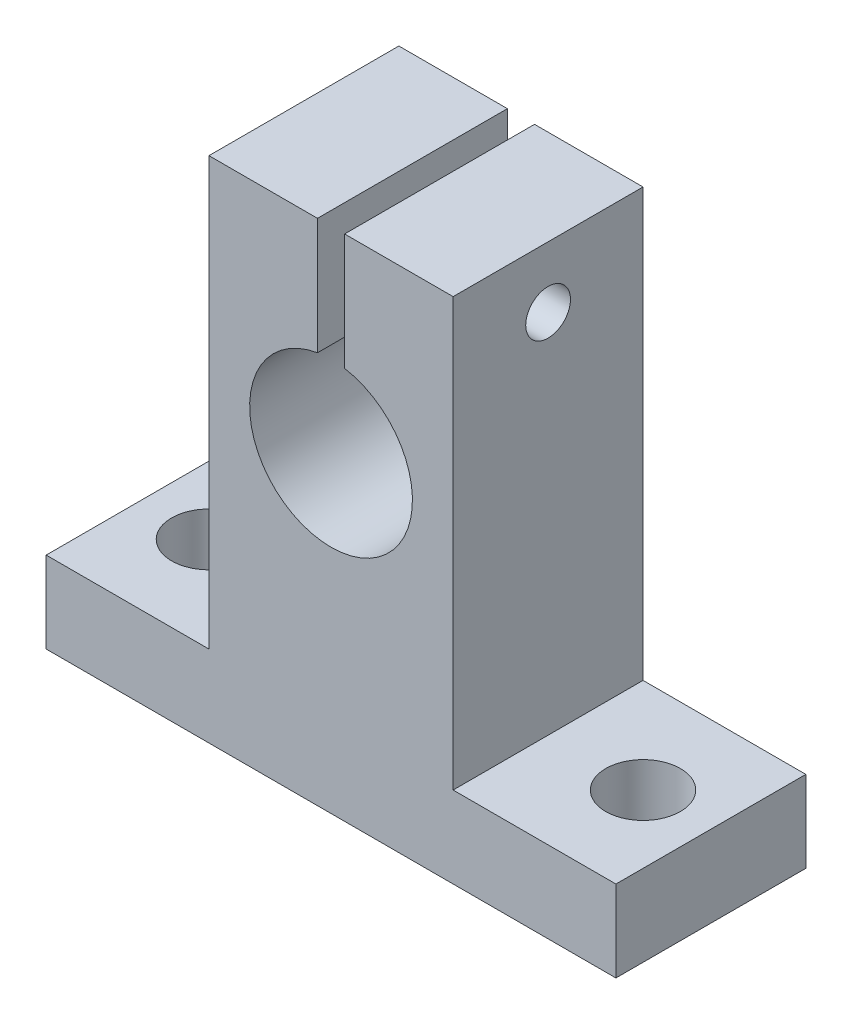
ISO-10303-21;
HEADER;
FILE_DESCRIPTION(('STEP AP214'),'2;1');
FILE_NAME('part.step','',(''),(''),'','','');
FILE_SCHEMA(('AUTOMOTIVE_DESIGN { 1 0 10303 214 1 1 1 1 }'));
ENDSEC;
DATA;
#1=APPLICATION_CONTEXT('core data for automotive mechanical design processes');
#2=APPLICATION_PROTOCOL_DEFINITION('international standard','automotive_design',2000,#1);
#3=PRODUCT_CONTEXT('',#1,'mechanical');
#4=PRODUCT('Part','Part','',(#3));
#5=PRODUCT_RELATED_PRODUCT_CATEGORY('part','',(#4));
#6=PRODUCT_DEFINITION_FORMATION('','',#4);
#7=PRODUCT_DEFINITION_CONTEXT('part definition',#1,'design');
#8=PRODUCT_DEFINITION('design','',#6,#7);
#9=PRODUCT_DEFINITION_SHAPE('','',#8);
#10=(LENGTH_UNIT() NAMED_UNIT(*) SI_UNIT(.MILLI.,.METRE.));
#11=(NAMED_UNIT(*) PLANE_ANGLE_UNIT() SI_UNIT($,.RADIAN.));
#12=(NAMED_UNIT(*) SI_UNIT($,.STERADIAN.) SOLID_ANGLE_UNIT());
#13=UNCERTAINTY_MEASURE_WITH_UNIT(LENGTH_MEASURE(1.E-05),#10,'distance_accuracy_value','');
#14=(GEOMETRIC_REPRESENTATION_CONTEXT(3) GLOBAL_UNCERTAINTY_ASSIGNED_CONTEXT((#13)) GLOBAL_UNIT_ASSIGNED_CONTEXT((#10,
#11,#12)) REPRESENTATION_CONTEXT('',''));
#15=CARTESIAN_POINT('',(0.,0.,0.));
#16=DIRECTION('',(0.,0.,1.));
#17=DIRECTION('',(1.,0.,0.));
#18=AXIS2_PLACEMENT_3D('',#15,#16,#17);
#19=CARTESIAN_POINT('',(0.,0.,14.));
#20=DIRECTION('',(0.,0.,1.));
#21=DIRECTION('',(1.,0.,0.));
#22=AXIS2_PLACEMENT_3D('',#19,#20,#21);
#23=PLANE('',#22);
#24=DIRECTION('',(0.,1.,0.));
#25=VECTOR('',#24,1.);
#26=CARTESIAN_POINT('',(1.,0.,14.));
#27=LINE('',#26,#25);
#28=CARTESIAN_POINT('',(1.,5.91607978309962,14.));
#29=VERTEX_POINT('',#28);
#30=CARTESIAN_POINT('',(1.,14.5,14.));
#31=VERTEX_POINT('',#30);
#32=EDGE_CURVE('E175',#29,#31,#27,.T.);
#33=ORIENTED_EDGE('',*,*,#32,.F.);
#34=CARTESIAN_POINT('',(0.,0.,14.));
#35=DIRECTION('',(0.,0.,-1.));
#36=DIRECTION('',(-1.,0.,0.));
#37=AXIS2_PLACEMENT_3D('',#34,#35,#36);
#38=CIRCLE('',#37,6.);
#39=CARTESIAN_POINT('',(-1.,5.91607978309961,14.));
#40=VERTEX_POINT('',#39);
#41=EDGE_CURVE('E48',#29,#40,#38,.T.);
#42=ORIENTED_EDGE('',*,*,#41,.T.);
#43=DIRECTION('',(0.,1.,0.));
#44=VECTOR('',#43,1.);
#45=CARTESIAN_POINT('',(-1.,0.,14.));
#46=LINE('',#45,#44);
#47=CARTESIAN_POINT('',(-1.,14.5,14.));
#48=VERTEX_POINT('',#47);
#49=EDGE_CURVE('E88',#40,#48,#46,.T.);
#50=ORIENTED_EDGE('',*,*,#49,.T.);
#51=DIRECTION('',(-1.,0.,0.));
#52=VECTOR('',#51,1.);
#53=CARTESIAN_POINT('',(-1.,14.5,14.));
#54=LINE('',#53,#52);
#55=CARTESIAN_POINT('',(-9.,14.5,14.));
#56=VERTEX_POINT('',#55);
#57=EDGE_CURVE('E103',#48,#56,#54,.T.);
#58=ORIENTED_EDGE('',*,*,#57,.T.);
#59=DIRECTION('',(0.,-1.,0.));
#60=VECTOR('',#59,1.);
#61=CARTESIAN_POINT('',(-9.,14.5,14.));
#62=LINE('',#61,#60);
#63=CARTESIAN_POINT('',(-8.99999999999999,-17.,14.));
#64=VERTEX_POINT('',#63);
#65=EDGE_CURVE('E96',#56,#64,#62,.T.);
#66=ORIENTED_EDGE('',*,*,#65,.T.);
#67=DIRECTION('',(-1.,0.,0.));
#68=VECTOR('',#67,1.);
#69=CARTESIAN_POINT('',(-8.99999999999999,-17.,14.));
#70=LINE('',#69,#68);
#71=CARTESIAN_POINT('',(-21.,-17.,14.));
#72=VERTEX_POINT('',#71);
#73=EDGE_CURVE('E100',#64,#72,#70,.T.);
#74=ORIENTED_EDGE('',*,*,#73,.T.);
#75=DIRECTION('',(0.,-1.,0.));
#76=VECTOR('',#75,1.);
#77=CARTESIAN_POINT('',(-21.,-17.,14.));
#78=LINE('',#77,#76);
#79=CARTESIAN_POINT('',(-21.,-23.,14.));
#80=VERTEX_POINT('',#79);
#81=EDGE_CURVE('E57',#72,#80,#78,.T.);
#82=ORIENTED_EDGE('',*,*,#81,.T.);
#83=DIRECTION('',(1.,0.,0.));
#84=VECTOR('',#83,1.);
#85=CARTESIAN_POINT('',(-21.,-23.,14.));
#86=LINE('',#85,#84);
#87=CARTESIAN_POINT('',(21.,-23.,14.));
#88=VERTEX_POINT('',#87);
#89=EDGE_CURVE('E136',#80,#88,#86,.T.);
#90=ORIENTED_EDGE('',*,*,#89,.T.);
#91=DIRECTION('',(0.,-1.,0.));
#92=VECTOR('',#91,1.);
#93=CARTESIAN_POINT('',(21.,-17.,14.));
#94=LINE('',#93,#92);
#95=CARTESIAN_POINT('',(21.,-17.,14.));
#96=VERTEX_POINT('',#95);
#97=EDGE_CURVE('E162',#96,#88,#94,.T.);
#98=ORIENTED_EDGE('',*,*,#97,.F.);
#99=DIRECTION('',(1.,0.,0.));
#100=VECTOR('',#99,1.);
#101=CARTESIAN_POINT('',(8.99999999999999,-17.,14.));
#102=LINE('',#101,#100);
#103=CARTESIAN_POINT('',(8.99999999999999,-17.,14.));
#104=VERTEX_POINT('',#103);
#105=EDGE_CURVE('E165',#104,#96,#102,.T.);
#106=ORIENTED_EDGE('',*,*,#105,.F.);
#107=DIRECTION('',(0.,-1.,0.));
#108=VECTOR('',#107,1.);
#109=CARTESIAN_POINT('',(9.,14.5,14.));
#110=LINE('',#109,#108);
#111=CARTESIAN_POINT('',(9.,14.5,14.));
#112=VERTEX_POINT('',#111);
#113=EDGE_CURVE('E169',#112,#104,#110,.T.);
#114=ORIENTED_EDGE('',*,*,#113,.F.);
#115=DIRECTION('',(1.,0.,0.));
#116=VECTOR('',#115,1.);
#117=CARTESIAN_POINT('',(1.,14.5,14.));
#118=LINE('',#117,#116);
#119=EDGE_CURVE('E172',#31,#112,#118,.T.);
#120=ORIENTED_EDGE('',*,*,#119,.F.);
#121=EDGE_LOOP('',(#33,#42,#50,#58,#66,#74,#82,#90,#98,#106,#114,#120));
#122=FACE_BOUND('',#121,.T.);
#123=ADVANCED_FACE('F34',(#122),#23,.T.);
#124=CARTESIAN_POINT('',(0.,0.,0.));
#125=DIRECTION('',(0.,0.,1.));
#126=DIRECTION('',(1.,0.,0.));
#127=AXIS2_PLACEMENT_3D('',#124,#125,#126);
#128=PLANE('',#127);
#129=CARTESIAN_POINT('',(0.,0.,0.));
#130=DIRECTION('',(0.,0.,-1.));
#131=DIRECTION('',(-1.,0.,0.));
#132=AXIS2_PLACEMENT_3D('',#129,#130,#131);
#133=CIRCLE('',#132,6.);
#134=CARTESIAN_POINT('',(1.,5.91607978309962,0.));
#135=VERTEX_POINT('',#134);
#136=CARTESIAN_POINT('',(-1.,5.91607978309962,0.));
#137=VERTEX_POINT('',#136);
#138=EDGE_CURVE('E244',#135,#137,#133,.T.);
#139=ORIENTED_EDGE('',*,*,#138,.F.);
#140=DIRECTION('',(0.,1.,0.));
#141=VECTOR('',#140,1.);
#142=CARTESIAN_POINT('',(1.,0.,0.));
#143=LINE('',#142,#141);
#144=CARTESIAN_POINT('',(1.,14.5,0.));
#145=VERTEX_POINT('',#144);
#146=EDGE_CURVE('E166',#135,#145,#143,.T.);
#147=ORIENTED_EDGE('',*,*,#146,.T.);
#148=DIRECTION('',(1.,0.,0.));
#149=VECTOR('',#148,1.);
#150=CARTESIAN_POINT('',(1.,14.5,0.));
#151=LINE('',#150,#149);
#152=CARTESIAN_POINT('',(9.,14.5,0.));
#153=VERTEX_POINT('',#152);
#154=EDGE_CURVE('E187',#145,#153,#151,.T.);
#155=ORIENTED_EDGE('',*,*,#154,.T.);
#156=DIRECTION('',(0.,-1.,0.));
#157=VECTOR('',#156,1.);
#158=CARTESIAN_POINT('',(9.,14.5,0.));
#159=LINE('',#158,#157);
#160=CARTESIAN_POINT('',(8.99999999999999,-17.,0.));
#161=VERTEX_POINT('',#160);
#162=EDGE_CURVE('E184',#153,#161,#159,.T.);
#163=ORIENTED_EDGE('',*,*,#162,.T.);
#164=DIRECTION('',(1.,0.,0.));
#165=VECTOR('',#164,1.);
#166=CARTESIAN_POINT('',(8.99999999999999,-17.,0.));
#167=LINE('',#166,#165);
#168=CARTESIAN_POINT('',(21.,-17.,0.));
#169=VERTEX_POINT('',#168);
#170=EDGE_CURVE('E181',#161,#169,#167,.T.);
#171=ORIENTED_EDGE('',*,*,#170,.T.);
#172=DIRECTION('',(0.,-1.,0.));
#173=VECTOR('',#172,1.);
#174=CARTESIAN_POINT('',(21.,-17.,0.));
#175=LINE('',#174,#173);
#176=CARTESIAN_POINT('',(21.,-23.,0.));
#177=VERTEX_POINT('',#176);
#178=EDGE_CURVE('E161',#169,#177,#175,.T.);
#179=ORIENTED_EDGE('',*,*,#178,.T.);
#180=DIRECTION('',(1.,0.,0.));
#181=VECTOR('',#180,1.);
#182=CARTESIAN_POINT('',(-21.,-23.,0.));
#183=LINE('',#182,#181);
#184=CARTESIAN_POINT('',(-21.,-23.,0.));
#185=VERTEX_POINT('',#184);
#186=EDGE_CURVE('E124',#185,#177,#183,.T.);
#187=ORIENTED_EDGE('',*,*,#186,.F.);
#188=DIRECTION('',(0.,-1.,0.));
#189=VECTOR('',#188,1.);
#190=CARTESIAN_POINT('',(-21.,-17.,0.));
#191=LINE('',#190,#189);
#192=CARTESIAN_POINT('',(-21.,-17.,0.));
#193=VERTEX_POINT('',#192);
#194=EDGE_CURVE('E81',#193,#185,#191,.T.);
#195=ORIENTED_EDGE('',*,*,#194,.F.);
#196=DIRECTION('',(-1.,0.,0.));
#197=VECTOR('',#196,1.);
#198=CARTESIAN_POINT('',(-8.99999999999999,-17.,0.));
#199=LINE('',#198,#197);
#200=CARTESIAN_POINT('',(-8.99999999999999,-17.,0.));
#201=VERTEX_POINT('',#200);
#202=EDGE_CURVE('E133',#201,#193,#199,.T.);
#203=ORIENTED_EDGE('',*,*,#202,.F.);
#204=DIRECTION('',(0.,-1.,0.));
#205=VECTOR('',#204,1.);
#206=CARTESIAN_POINT('',(-9.,14.5,0.));
#207=LINE('',#206,#205);
#208=CARTESIAN_POINT('',(-9.,14.5,0.));
#209=VERTEX_POINT('',#208);
#210=EDGE_CURVE('E112',#209,#201,#207,.T.);
#211=ORIENTED_EDGE('',*,*,#210,.F.);
#212=DIRECTION('',(-1.,0.,0.));
#213=VECTOR('',#212,1.);
#214=CARTESIAN_POINT('',(-1.,14.5,0.));
#215=LINE('',#214,#213);
#216=CARTESIAN_POINT('',(-1.,14.5,0.));
#217=VERTEX_POINT('',#216);
#218=EDGE_CURVE('E130',#217,#209,#215,.T.);
#219=ORIENTED_EDGE('',*,*,#218,.F.);
#220=DIRECTION('',(0.,1.,0.));
#221=VECTOR('',#220,1.);
#222=CARTESIAN_POINT('',(-1.,0.,0.));
#223=LINE('',#222,#221);
#224=EDGE_CURVE('E127',#137,#217,#223,.T.);
#225=ORIENTED_EDGE('',*,*,#224,.F.);
#226=EDGE_LOOP('',(#139,#147,#155,#163,#171,#179,#187,#195,#203,#211,#219,#225));
#227=FACE_BOUND('',#226,.T.);
#228=ADVANCED_FACE('F241',(#227),#128,.F.);
#229=CARTESIAN_POINT('',(-21.,-23.,14.));
#230=DIRECTION('',(0.,1.,0.));
#231=DIRECTION('',(0.,0.,1.));
#232=AXIS2_PLACEMENT_3D('',#229,#230,#231);
#233=PLANE('',#232);
#234=CARTESIAN_POINT('',(16.,-23.,7.));
#235=DIRECTION('',(0.,-1.,0.));
#236=DIRECTION('',(0.,0.,-1.));
#237=AXIS2_PLACEMENT_3D('',#234,#235,#236);
#238=CIRCLE('',#237,2.75);
#239=CARTESIAN_POINT('',(16.,-23.,4.25000000000001));
#240=VERTEX_POINT('',#239);
#241=EDGE_CURVE('E313',#240,#240,#238,.T.);
#242=ORIENTED_EDGE('',*,*,#241,.F.);
#243=EDGE_LOOP('',(#242));
#244=FACE_BOUND('',#243,.T.);
#245=CARTESIAN_POINT('',(-16.,-23.,7.));
#246=DIRECTION('',(0.,-1.,0.));
#247=DIRECTION('',(0.,0.,-1.));
#248=AXIS2_PLACEMENT_3D('',#245,#246,#247);
#249=CIRCLE('',#248,2.74999999999999);
#250=CARTESIAN_POINT('',(-16.,-23.,4.25000000000001));
#251=VERTEX_POINT('',#250);
#252=EDGE_CURVE('E307',#251,#251,#249,.T.);
#253=ORIENTED_EDGE('',*,*,#252,.F.);
#254=EDGE_LOOP('',(#253));
#255=FACE_BOUND('',#254,.T.);
#256=ORIENTED_EDGE('',*,*,#186,.T.);
#257=DIRECTION('',(0.,0.,-1.));
#258=VECTOR('',#257,1.);
#259=CARTESIAN_POINT('',(21.,-23.,14.));
#260=LINE('',#259,#258);
#261=EDGE_CURVE('E128',#88,#177,#260,.T.);
#262=ORIENTED_EDGE('',*,*,#261,.F.);
#263=ORIENTED_EDGE('',*,*,#89,.F.);
#264=DIRECTION('',(0.,0.,-1.));
#265=VECTOR('',#264,1.);
#266=CARTESIAN_POINT('',(-21.,-23.,14.));
#267=LINE('',#266,#265);
#268=EDGE_CURVE('E120',#80,#185,#267,.T.);
#269=ORIENTED_EDGE('',*,*,#268,.T.);
#270=EDGE_LOOP('',(#256,#262,#263,#269));
#271=FACE_BOUND('',#270,.T.);
#272=ADVANCED_FACE('F36',(#244,#255,#271),#233,.F.);
#273=CARTESIAN_POINT('',(-1.,0.,14.));
#274=DIRECTION('',(-1.,0.,0.));
#275=DIRECTION('',(0.,0.,1.));
#276=AXIS2_PLACEMENT_3D('',#273,#274,#275);
#277=PLANE('',#276);
#278=CARTESIAN_POINT('',(-1.,10.,7.));
#279=DIRECTION('',(-1.,0.,0.));
#280=DIRECTION('',(0.,0.,1.));
#281=AXIS2_PLACEMENT_3D('',#278,#279,#280);
#282=CIRCLE('',#281,1.64999999999999);
#283=CARTESIAN_POINT('',(-1.,10.,8.64999999999999));
#284=VERTEX_POINT('',#283);
#285=EDGE_CURVE('E148',#284,#284,#282,.T.);
#286=ORIENTED_EDGE('',*,*,#285,.T.);
#287=EDGE_LOOP('',(#286));
#288=FACE_BOUND('',#287,.T.);
#289=ORIENTED_EDGE('',*,*,#49,.F.);
#290=DIRECTION('',(0.,0.,-1.));
#291=VECTOR('',#290,1.);
#292=CARTESIAN_POINT('',(-1.,5.91607978309962,0.));
#293=LINE('',#292,#291);
#294=EDGE_CURVE('E151',#40,#137,#293,.T.);
#295=ORIENTED_EDGE('',*,*,#294,.T.);
#296=ORIENTED_EDGE('',*,*,#224,.T.);
#297=DIRECTION('',(0.,0.,-1.));
#298=VECTOR('',#297,1.);
#299=CARTESIAN_POINT('',(-1.,14.5,14.));
#300=LINE('',#299,#298);
#301=EDGE_CURVE('E42',#48,#217,#300,.T.);
#302=ORIENTED_EDGE('',*,*,#301,.F.);
#303=EDGE_LOOP('',(#289,#295,#296,#302));
#304=FACE_BOUND('',#303,.T.);
#305=ADVANCED_FACE('F282',(#288,#304),#277,.F.);
#306=CARTESIAN_POINT('',(-1.,14.5,14.));
#307=DIRECTION('',(0.,-1.,0.));
#308=DIRECTION('',(1.,0.,0.));
#309=AXIS2_PLACEMENT_3D('',#306,#307,#308);
#310=PLANE('',#309);
#311=ORIENTED_EDGE('',*,*,#218,.T.);
#312=DIRECTION('',(0.,0.,-1.));
#313=VECTOR('',#312,1.);
#314=CARTESIAN_POINT('',(-9.,14.5,14.));
#315=LINE('',#314,#313);
#316=EDGE_CURVE('E115',#56,#209,#315,.T.);
#317=ORIENTED_EDGE('',*,*,#316,.F.);
#318=ORIENTED_EDGE('',*,*,#57,.F.);
#319=ORIENTED_EDGE('',*,*,#301,.T.);
#320=EDGE_LOOP('',(#311,#317,#318,#319));
#321=FACE_BOUND('',#320,.T.);
#322=ADVANCED_FACE('F279',(#321),#310,.F.);
#323=CARTESIAN_POINT('',(-9.,14.5,14.));
#324=DIRECTION('',(1.,0.,0.));
#325=DIRECTION('',(0.,1.,0.));
#326=AXIS2_PLACEMENT_3D('',#323,#324,#325);
#327=PLANE('',#326);
#328=CARTESIAN_POINT('',(-9.,10.,7.));
#329=DIRECTION('',(-1.,0.,0.));
#330=DIRECTION('',(0.,0.,1.));
#331=AXIS2_PLACEMENT_3D('',#328,#329,#330);
#332=CIRCLE('',#331,1.64999999999999);
#333=CARTESIAN_POINT('',(-9.,10.,8.64999999999999));
#334=VERTEX_POINT('',#333);
#335=EDGE_CURVE('E144',#334,#334,#332,.T.);
#336=ORIENTED_EDGE('',*,*,#335,.F.);
#337=EDGE_LOOP('',(#336));
#338=FACE_BOUND('',#337,.T.);
#339=ORIENTED_EDGE('',*,*,#210,.T.);
#340=DIRECTION('',(0.,0.,-1.));
#341=VECTOR('',#340,1.);
#342=CARTESIAN_POINT('',(-8.99999999999999,-17.,14.));
#343=LINE('',#342,#341);
#344=EDGE_CURVE('E109',#64,#201,#343,.T.);
#345=ORIENTED_EDGE('',*,*,#344,.F.);
#346=ORIENTED_EDGE('',*,*,#65,.F.);
#347=ORIENTED_EDGE('',*,*,#316,.T.);
#348=EDGE_LOOP('',(#339,#345,#346,#347));
#349=FACE_BOUND('',#348,.T.);
#350=ADVANCED_FACE('F110',(#338,#349),#327,.F.);
#351=CARTESIAN_POINT('',(-8.99999999999999,-17.,14.));
#352=DIRECTION('',(0.,-1.,0.));
#353=DIRECTION('',(0.,0.,-1.));
#354=AXIS2_PLACEMENT_3D('',#351,#352,#353);
#355=PLANE('',#354);
#356=CARTESIAN_POINT('',(-16.,-17.,7.));
#357=DIRECTION('',(0.,-1.,0.));
#358=DIRECTION('',(0.,0.,-1.));
#359=AXIS2_PLACEMENT_3D('',#356,#357,#358);
#360=CIRCLE('',#359,2.74999999999999);
#361=CARTESIAN_POINT('',(-16.,-17.,4.25000000000001));
#362=VERTEX_POINT('',#361);
#363=EDGE_CURVE('E302',#362,#362,#360,.T.);
#364=ORIENTED_EDGE('',*,*,#363,.T.);
#365=EDGE_LOOP('',(#364));
#366=FACE_BOUND('',#365,.T.);
#367=ORIENTED_EDGE('',*,*,#202,.T.);
#368=DIRECTION('',(0.,0.,-1.));
#369=VECTOR('',#368,1.);
#370=CARTESIAN_POINT('',(-21.,-17.,14.));
#371=LINE('',#370,#369);
#372=EDGE_CURVE('E116',#72,#193,#371,.T.);
#373=ORIENTED_EDGE('',*,*,#372,.F.);
#374=ORIENTED_EDGE('',*,*,#73,.F.);
#375=ORIENTED_EDGE('',*,*,#344,.T.);
#376=EDGE_LOOP('',(#367,#373,#374,#375));
#377=FACE_BOUND('',#376,.T.);
#378=ADVANCED_FACE('F118',(#366,#377),#355,.F.);
#379=CARTESIAN_POINT('',(-21.,-17.,14.));
#380=DIRECTION('',(1.,0.,0.));
#381=DIRECTION('',(0.,0.,-1.));
#382=AXIS2_PLACEMENT_3D('',#379,#380,#381);
#383=PLANE('',#382);
#384=ORIENTED_EDGE('',*,*,#194,.T.);
#385=ORIENTED_EDGE('',*,*,#268,.F.);
#386=ORIENTED_EDGE('',*,*,#81,.F.);
#387=ORIENTED_EDGE('',*,*,#372,.T.);
#388=EDGE_LOOP('',(#384,#385,#386,#387));
#389=FACE_BOUND('',#388,.T.);
#390=ADVANCED_FACE('F271',(#389),#383,.F.);
#391=CARTESIAN_POINT('',(21.,-17.,14.));
#392=DIRECTION('',(1.,0.,0.));
#393=DIRECTION('',(0.,0.,-1.));
#394=AXIS2_PLACEMENT_3D('',#391,#392,#393);
#395=PLANE('',#394);
#396=ORIENTED_EDGE('',*,*,#178,.F.);
#397=DIRECTION('',(0.,0.,-1.));
#398=VECTOR('',#397,1.);
#399=CARTESIAN_POINT('',(21.,-17.,14.));
#400=LINE('',#399,#398);
#401=EDGE_CURVE('E200',#96,#169,#400,.T.);
#402=ORIENTED_EDGE('',*,*,#401,.F.);
#403=ORIENTED_EDGE('',*,*,#97,.T.);
#404=ORIENTED_EDGE('',*,*,#261,.T.);
#405=EDGE_LOOP('',(#396,#402,#403,#404));
#406=FACE_BOUND('',#405,.T.);
#407=ADVANCED_FACE('F219',(#406),#395,.T.);
#408=CARTESIAN_POINT('',(8.99999999999999,-17.,14.));
#409=DIRECTION('',(0.,1.,0.));
#410=DIRECTION('',(0.,0.,1.));
#411=AXIS2_PLACEMENT_3D('',#408,#409,#410);
#412=PLANE('',#411);
#413=CARTESIAN_POINT('',(16.,-17.,7.));
#414=DIRECTION('',(0.,1.,0.));
#415=DIRECTION('',(0.,0.,1.));
#416=AXIS2_PLACEMENT_3D('',#413,#414,#415);
#417=CIRCLE('',#416,2.74999999999999);
#418=CARTESIAN_POINT('',(16.,-17.,9.74999999999999));
#419=VERTEX_POINT('',#418);
#420=EDGE_CURVE('E310',#419,#419,#417,.T.);
#421=ORIENTED_EDGE('',*,*,#420,.F.);
#422=EDGE_LOOP('',(#421));
#423=FACE_BOUND('',#422,.T.);
#424=ORIENTED_EDGE('',*,*,#170,.F.);
#425=DIRECTION('',(0.,0.,-1.));
#426=VECTOR('',#425,1.);
#427=CARTESIAN_POINT('',(8.99999999999999,-17.,14.));
#428=LINE('',#427,#426);
#429=EDGE_CURVE('E197',#104,#161,#428,.T.);
#430=ORIENTED_EDGE('',*,*,#429,.F.);
#431=ORIENTED_EDGE('',*,*,#105,.T.);
#432=ORIENTED_EDGE('',*,*,#401,.T.);
#433=EDGE_LOOP('',(#424,#430,#431,#432));
#434=FACE_BOUND('',#433,.T.);
#435=ADVANCED_FACE('F225',(#423,#434),#412,.T.);
#436=CARTESIAN_POINT('',(9.,14.5,14.));
#437=DIRECTION('',(1.,0.,0.));
#438=DIRECTION('',(0.,1.,0.));
#439=AXIS2_PLACEMENT_3D('',#436,#437,#438);
#440=PLANE('',#439);
#441=CARTESIAN_POINT('',(9.,10.,7.));
#442=DIRECTION('',(1.,0.,0.));
#443=DIRECTION('',(0.,1.,0.));
#444=AXIS2_PLACEMENT_3D('',#441,#442,#443);
#445=CIRCLE('',#444,1.64999999999999);
#446=CARTESIAN_POINT('',(9.,11.65,7.));
#447=VERTEX_POINT('',#446);
#448=EDGE_CURVE('E143',#447,#447,#445,.T.);
#449=ORIENTED_EDGE('',*,*,#448,.F.);
#450=EDGE_LOOP('',(#449));
#451=FACE_BOUND('',#450,.T.);
#452=ORIENTED_EDGE('',*,*,#162,.F.);
#453=DIRECTION('',(0.,0.,-1.));
#454=VECTOR('',#453,1.);
#455=CARTESIAN_POINT('',(9.,14.5,14.));
#456=LINE('',#455,#454);
#457=EDGE_CURVE('E194',#112,#153,#456,.T.);
#458=ORIENTED_EDGE('',*,*,#457,.F.);
#459=ORIENTED_EDGE('',*,*,#113,.T.);
#460=ORIENTED_EDGE('',*,*,#429,.T.);
#461=EDGE_LOOP('',(#452,#458,#459,#460));
#462=FACE_BOUND('',#461,.T.);
#463=ADVANCED_FACE('F252',(#451,#462),#440,.T.);
#464=CARTESIAN_POINT('',(1.,14.5,14.));
#465=DIRECTION('',(0.,1.,0.));
#466=DIRECTION('',(-1.,0.,0.));
#467=AXIS2_PLACEMENT_3D('',#464,#465,#466);
#468=PLANE('',#467);
#469=ORIENTED_EDGE('',*,*,#154,.F.);
#470=DIRECTION('',(0.,0.,-1.));
#471=VECTOR('',#470,1.);
#472=CARTESIAN_POINT('',(1.,14.5,14.));
#473=LINE('',#472,#471);
#474=EDGE_CURVE('E178',#31,#145,#473,.T.);
#475=ORIENTED_EDGE('',*,*,#474,.F.);
#476=ORIENTED_EDGE('',*,*,#119,.T.);
#477=ORIENTED_EDGE('',*,*,#457,.T.);
#478=EDGE_LOOP('',(#469,#475,#476,#477));
#479=FACE_BOUND('',#478,.T.);
#480=ADVANCED_FACE('F250',(#479),#468,.T.);
#481=CARTESIAN_POINT('',(1.,0.,14.));
#482=DIRECTION('',(-1.,0.,0.));
#483=DIRECTION('',(0.,0.,1.));
#484=AXIS2_PLACEMENT_3D('',#481,#482,#483);
#485=PLANE('',#484);
#486=DIRECTION('',(0.,0.,-1.));
#487=VECTOR('',#486,1.);
#488=CARTESIAN_POINT('',(1.,5.91607978309962,0.));
#489=LINE('',#488,#487);
#490=EDGE_CURVE('E11',#29,#135,#489,.T.);
#491=ORIENTED_EDGE('',*,*,#490,.F.);
#492=ORIENTED_EDGE('',*,*,#32,.T.);
#493=ORIENTED_EDGE('',*,*,#474,.T.);
#494=ORIENTED_EDGE('',*,*,#146,.F.);
#495=EDGE_LOOP('',(#491,#492,#493,#494));
#496=FACE_BOUND('',#495,.T.);
#497=CARTESIAN_POINT('',(1.,10.,7.));
#498=DIRECTION('',(-1.,0.,0.));
#499=DIRECTION('',(0.,0.,1.));
#500=AXIS2_PLACEMENT_3D('',#497,#498,#499);
#501=CIRCLE('',#500,1.64999999999999);
#502=CARTESIAN_POINT('',(1.,10.,8.64999999999999));
#503=VERTEX_POINT('',#502);
#504=EDGE_CURVE('E141',#503,#503,#501,.T.);
#505=ORIENTED_EDGE('',*,*,#504,.F.);
#506=EDGE_LOOP('',(#505));
#507=FACE_BOUND('',#506,.T.);
#508=ADVANCED_FACE('F247',(#496,#507),#485,.T.);
#509=CARTESIAN_POINT('',(-9.,10.,7.));
#510=DIRECTION('',(-1.,0.,0.));
#511=DIRECTION('',(0.,0.,1.));
#512=AXIS2_PLACEMENT_3D('',#509,#510,#511);
#513=CYLINDRICAL_SURFACE('',#512,1.64999999999999);
#514=ORIENTED_EDGE('',*,*,#448,.T.);
#515=EDGE_LOOP('',(#514));
#516=FACE_BOUND('',#515,.T.);
#517=ORIENTED_EDGE('',*,*,#504,.T.);
#518=EDGE_LOOP('',(#517));
#519=FACE_BOUND('',#518,.T.);
#520=ADVANCED_FACE('F258',(#516,#519),#513,.F.);
#521=ORIENTED_EDGE('',*,*,#335,.T.);
#522=EDGE_LOOP('',(#521));
#523=FACE_BOUND('',#522,.T.);
#524=ORIENTED_EDGE('',*,*,#285,.F.);
#525=EDGE_LOOP('',(#524));
#526=FACE_BOUND('',#525,.T.);
#527=ADVANCED_FACE('F333',(#523,#526),#513,.F.);
#528=CARTESIAN_POINT('',(0.,0.,0.));
#529=DIRECTION('',(0.,0.,-1.));
#530=DIRECTION('',(-1.,0.,0.));
#531=AXIS2_PLACEMENT_3D('',#528,#529,#530);
#532=CYLINDRICAL_SURFACE('',#531,6.);
#533=ORIENTED_EDGE('',*,*,#41,.F.);
#534=ORIENTED_EDGE('',*,*,#490,.T.);
#535=ORIENTED_EDGE('',*,*,#138,.T.);
#536=ORIENTED_EDGE('',*,*,#294,.F.);
#537=EDGE_LOOP('',(#533,#534,#535,#536));
#538=FACE_BOUND('',#537,.T.);
#539=ADVANCED_FACE('F324',(#538),#532,.F.);
#540=CARTESIAN_POINT('',(-16.,-23.,7.));
#541=DIRECTION('',(0.,-1.,0.));
#542=DIRECTION('',(0.,0.,-1.));
#543=AXIS2_PLACEMENT_3D('',#540,#541,#542);
#544=CYLINDRICAL_SURFACE('',#543,2.74999999999999);
#545=ORIENTED_EDGE('',*,*,#252,.T.);
#546=EDGE_LOOP('',(#545));
#547=FACE_BOUND('',#546,.T.);
#548=ORIENTED_EDGE('',*,*,#363,.F.);
#549=EDGE_LOOP('',(#548));
#550=FACE_BOUND('',#549,.T.);
#551=ADVANCED_FACE('F321',(#547,#550),#544,.F.);
#552=CARTESIAN_POINT('',(16.,-23.,7.));
#553=DIRECTION('',(0.,-1.,0.));
#554=DIRECTION('',(0.,0.,-1.));
#555=AXIS2_PLACEMENT_3D('',#552,#553,#554);
#556=CYLINDRICAL_SURFACE('',#555,2.74999999999999);
#557=ORIENTED_EDGE('',*,*,#420,.T.);
#558=EDGE_LOOP('',(#557));
#559=FACE_BOUND('',#558,.T.);
#560=ORIENTED_EDGE('',*,*,#241,.T.);
#561=EDGE_LOOP('',(#560));
#562=FACE_BOUND('',#561,.T.);
#563=ADVANCED_FACE('F317',(#559,#562),#556,.F.);
#564=CLOSED_SHELL('',(#123,#228,#272,#305,#322,#350,#378,#390,#407,#435,#463,#480,#508,#520,
#527,#539,#551,#563));
#565=MANIFOLD_SOLID_BREP('B2',#564);
#566=ADVANCED_BREP_SHAPE_REPRESENTATION('',(#18,#565),#14);
#567=SHAPE_DEFINITION_REPRESENTATION(#9,#566);
ENDSEC;
END-ISO-10303-21;
